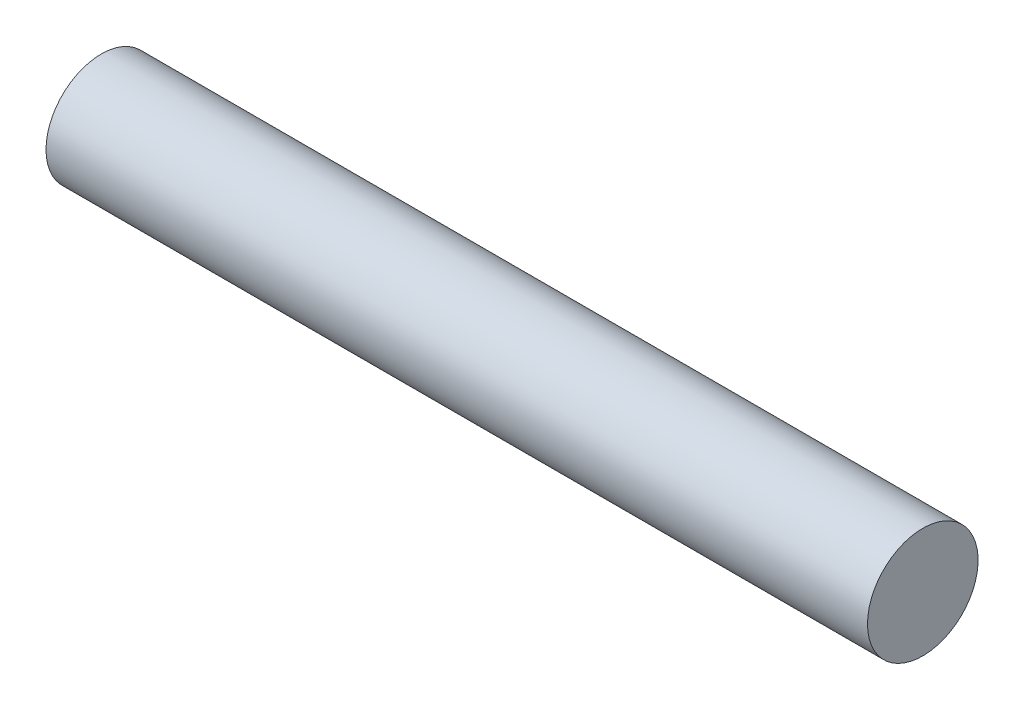
ISO-10303-21;
HEADER;
FILE_DESCRIPTION(('STEP AP214'),'2;1');
FILE_NAME('part.step','',(''),(''),'','','');
FILE_SCHEMA(('AUTOMOTIVE_DESIGN { 1 0 10303 214 1 1 1 1 }'));
ENDSEC;
DATA;
#1=APPLICATION_CONTEXT('core data for automotive mechanical design processes');
#2=APPLICATION_PROTOCOL_DEFINITION('international standard','automotive_design',2000,#1);
#3=PRODUCT_CONTEXT('',#1,'mechanical');
#4=PRODUCT('Part','Part','',(#3));
#5=PRODUCT_RELATED_PRODUCT_CATEGORY('part','',(#4));
#6=PRODUCT_DEFINITION_FORMATION('','',#4);
#7=PRODUCT_DEFINITION_CONTEXT('part definition',#1,'design');
#8=PRODUCT_DEFINITION('design','',#6,#7);
#9=PRODUCT_DEFINITION_SHAPE('','',#8);
#10=(LENGTH_UNIT() NAMED_UNIT(*) SI_UNIT(.MILLI.,.METRE.));
#11=(NAMED_UNIT(*) PLANE_ANGLE_UNIT() SI_UNIT($,.RADIAN.));
#12=(NAMED_UNIT(*) SI_UNIT($,.STERADIAN.) SOLID_ANGLE_UNIT());
#13=UNCERTAINTY_MEASURE_WITH_UNIT(LENGTH_MEASURE(1.E-05),#10,'distance_accuracy_value','');
#14=(GEOMETRIC_REPRESENTATION_CONTEXT(3) GLOBAL_UNCERTAINTY_ASSIGNED_CONTEXT((#13)) GLOBAL_UNIT_ASSIGNED_CONTEXT((#10,
#11,#12)) REPRESENTATION_CONTEXT('',''));
#15=CARTESIAN_POINT('',(0.,0.,0.));
#16=DIRECTION('',(0.,0.,1.));
#17=DIRECTION('',(1.,0.,0.));
#18=AXIS2_PLACEMENT_3D('',#15,#16,#17);
#19=CARTESIAN_POINT('',(-26.,0.,0.));
#20=DIRECTION('',(1.,0.,0.));
#21=DIRECTION('',(0.,0.,-1.));
#22=AXIS2_PLACEMENT_3D('',#19,#20,#21);
#23=PLANE('',#22);
#24=CARTESIAN_POINT('',(-26.,0.,0.));
#25=DIRECTION('',(-1.,0.,0.));
#26=DIRECTION('',(0.,0.,1.));
#27=AXIS2_PLACEMENT_3D('',#24,#25,#26);
#28=CIRCLE('',#27,3.5);
#29=CARTESIAN_POINT('',(-26.,0.,3.5));
#30=VERTEX_POINT('',#29);
#31=EDGE_CURVE('E9',#30,#30,#28,.T.);
#32=ORIENTED_EDGE('',*,*,#31,.T.);
#33=EDGE_LOOP('',(#32));
#34=FACE_BOUND('',#33,.T.);
#35=ADVANCED_FACE('F14',(#34),#23,.F.);
#36=CARTESIAN_POINT('',(-28.1129622748732,0.,0.));
#37=DIRECTION('',(-1.,0.,0.));
#38=DIRECTION('',(0.,0.,1.));
#39=AXIS2_PLACEMENT_3D('',#36,#37,#38);
#40=CYLINDRICAL_SURFACE('',#39,3.5);
#41=ORIENTED_EDGE('',*,*,#31,.F.);
#42=EDGE_LOOP('',(#41));
#43=FACE_BOUND('',#42,.T.);
#44=CARTESIAN_POINT('',(26.,0.,0.));
#45=DIRECTION('',(-1.,0.,0.));
#46=DIRECTION('',(0.,0.,1.));
#47=AXIS2_PLACEMENT_3D('',#44,#45,#46);
#48=CIRCLE('',#47,3.5);
#49=CARTESIAN_POINT('',(26.,0.,3.5));
#50=VERTEX_POINT('',#49);
#51=EDGE_CURVE('E20',#50,#50,#48,.T.);
#52=ORIENTED_EDGE('',*,*,#51,.T.);
#53=EDGE_LOOP('',(#52));
#54=FACE_BOUND('',#53,.T.);
#55=ADVANCED_FACE('F26',(#43,#54),#40,.T.);
#56=CARTESIAN_POINT('',(26.,3.5,0.));
#57=DIRECTION('',(-1.,0.,0.));
#58=DIRECTION('',(0.,0.,1.));
#59=AXIS2_PLACEMENT_3D('',#56,#57,#58);
#60=PLANE('',#59);
#61=ORIENTED_EDGE('',*,*,#51,.F.);
#62=EDGE_LOOP('',(#61));
#63=FACE_BOUND('',#62,.T.);
#64=ADVANCED_FACE('F28',(#63),#60,.F.);
#65=CLOSED_SHELL('',(#35,#55,#64));
#66=MANIFOLD_SOLID_BREP('B1',#65);
#67=ADVANCED_BREP_SHAPE_REPRESENTATION('',(#18,#66),#14);
#68=SHAPE_DEFINITION_REPRESENTATION(#9,#67);
ENDSEC;
END-ISO-10303-21;
